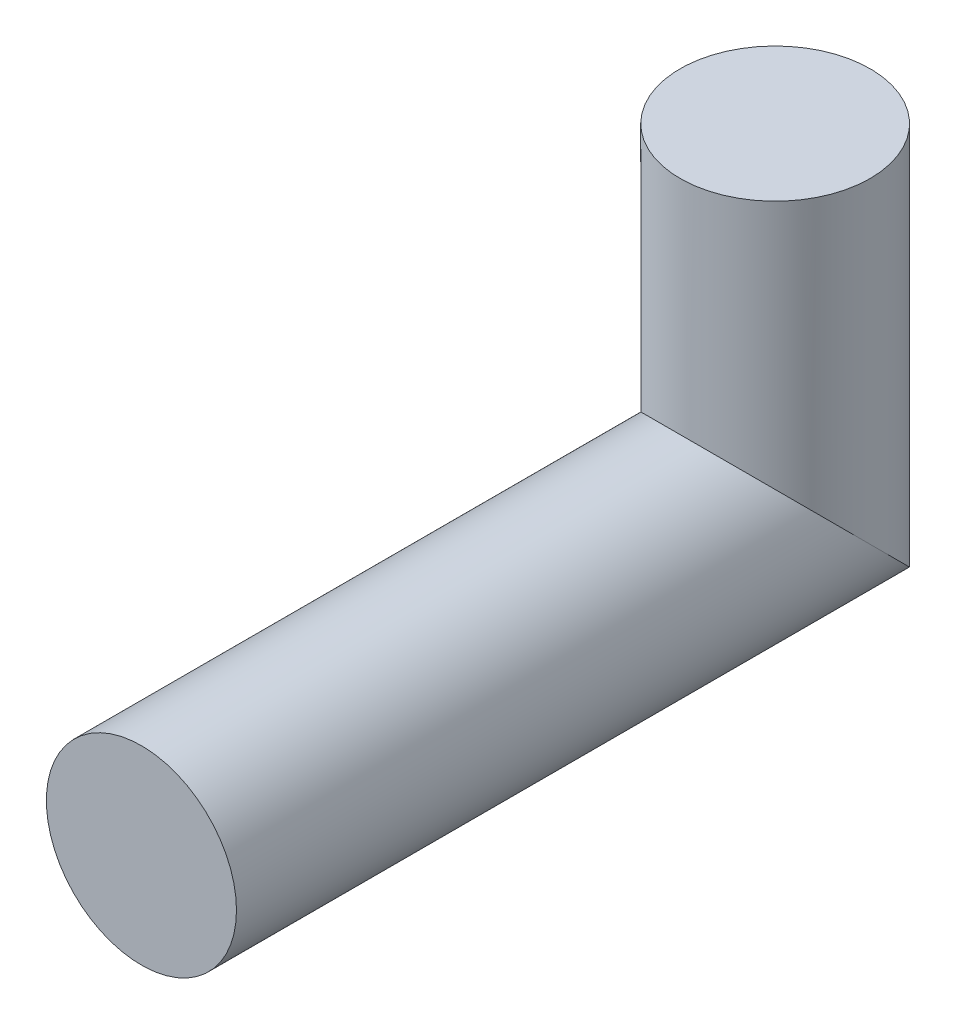
ISO-10303-21;
HEADER;
FILE_DESCRIPTION(('STEP AP214'),'2;1');
FILE_NAME('part.step','',(''),(''),'','','');
FILE_SCHEMA(('AUTOMOTIVE_DESIGN { 1 0 10303 214 1 1 1 1 }'));
ENDSEC;
DATA;
#1=APPLICATION_CONTEXT('core data for automotive mechanical design processes');
#2=APPLICATION_PROTOCOL_DEFINITION('international standard','automotive_design',2000,#1);
#3=PRODUCT_CONTEXT('',#1,'mechanical');
#4=PRODUCT('Part','Part','',(#3));
#5=PRODUCT_RELATED_PRODUCT_CATEGORY('part','',(#4));
#6=PRODUCT_DEFINITION_FORMATION('','',#4);
#7=PRODUCT_DEFINITION_CONTEXT('part definition',#1,'design');
#8=PRODUCT_DEFINITION('design','',#6,#7);
#9=PRODUCT_DEFINITION_SHAPE('','',#8);
#10=(LENGTH_UNIT() NAMED_UNIT(*) SI_UNIT(.MILLI.,.METRE.));
#11=(NAMED_UNIT(*) PLANE_ANGLE_UNIT() SI_UNIT($,.RADIAN.));
#12=(NAMED_UNIT(*) SI_UNIT($,.STERADIAN.) SOLID_ANGLE_UNIT());
#13=UNCERTAINTY_MEASURE_WITH_UNIT(LENGTH_MEASURE(1.E-05),#10,'distance_accuracy_value','');
#14=(GEOMETRIC_REPRESENTATION_CONTEXT(3) GLOBAL_UNCERTAINTY_ASSIGNED_CONTEXT((#13)) GLOBAL_UNIT_ASSIGNED_CONTEXT((#10,
#11,#12)) REPRESENTATION_CONTEXT('',''));
#15=CARTESIAN_POINT('',(0.,0.,0.));
#16=DIRECTION('',(0.,0.,1.));
#17=DIRECTION('',(1.,0.,0.));
#18=AXIS2_PLACEMENT_3D('',#15,#16,#17);
#19=CARTESIAN_POINT('',(0.,63.5,-127.));
#20=DIRECTION('',(0.,-1.,0.));
#21=DIRECTION('',(1.,0.,0.));
#22=AXIS2_PLACEMENT_3D('',#19,#20,#21);
#23=PLANE('',#22);
#24=CARTESIAN_POINT('',(0.,63.5,-127.));
#25=DIRECTION('',(0.,-1.,0.));
#26=DIRECTION('',(1.,0.,0.));
#27=AXIS2_PLACEMENT_3D('',#24,#25,#26);
#28=CIRCLE('',#27,19.05);
#29=CARTESIAN_POINT('',(19.05,63.5,-127.));
#30=VERTEX_POINT('',#29);
#31=EDGE_CURVE('E37',#30,#30,#28,.T.);
#32=ORIENTED_EDGE('',*,*,#31,.F.);
#33=EDGE_LOOP('',(#32));
#34=FACE_BOUND('',#33,.T.);
#35=ADVANCED_FACE('F34',(#34),#23,.F.);
#36=CARTESIAN_POINT('',(0.,0.,0.));
#37=DIRECTION('',(0.,0.,1.));
#38=DIRECTION('',(1.,0.,0.));
#39=AXIS2_PLACEMENT_3D('',#36,#37,#38);
#40=PLANE('',#39);
#41=CARTESIAN_POINT('',(0.,0.,0.));
#42=DIRECTION('',(0.,0.,1.));
#43=DIRECTION('',(1.,0.,0.));
#44=AXIS2_PLACEMENT_3D('',#41,#42,#43);
#45=CIRCLE('',#44,19.05);
#46=CARTESIAN_POINT('',(19.05,0.,0.));
#47=VERTEX_POINT('',#46);
#48=EDGE_CURVE('E41',#47,#47,#45,.T.);
#49=ORIENTED_EDGE('',*,*,#48,.T.);
#50=EDGE_LOOP('',(#49));
#51=FACE_BOUND('',#50,.T.);
#52=ADVANCED_FACE('F54',(#51),#40,.T.);
#53=CARTESIAN_POINT('',(0.,-42.01,-127.));
#54=DIRECTION('',(0.,1.,0.));
#55=DIRECTION('',(0.,0.,1.));
#56=AXIS2_PLACEMENT_3D('',#53,#54,#55);
#57=CYLINDRICAL_SURFACE('',#56,19.05);
#58=CARTESIAN_POINT('',(0.,0.,-127.));
#59=DIRECTION('',(0.,0.707106781186547,-0.707106781186547));
#60=DIRECTION('',(0.,-0.707106781186548,-0.707106781186548));
#61=AXIS2_PLACEMENT_3D('',#58,#59,#60);
#62=ELLIPSE('',#61,26.9407683632075,19.05);
#63=CARTESIAN_POINT('',(0.,-19.05,-146.05));
#64=VERTEX_POINT('',#63);
#65=EDGE_CURVE('E10',#64,#64,#62,.T.);
#66=ORIENTED_EDGE('',*,*,#65,.T.);
#67=EDGE_LOOP('',(#66));
#68=FACE_BOUND('',#67,.T.);
#69=ORIENTED_EDGE('',*,*,#31,.T.);
#70=EDGE_LOOP('',(#69));
#71=FACE_BOUND('',#70,.T.);
#72=ADVANCED_FACE('F51',(#68,#71),#57,.T.);
#73=CARTESIAN_POINT('',(0.,0.,0.));
#74=DIRECTION('',(0.,0.,-1.));
#75=DIRECTION('',(-1.,0.,0.));
#76=AXIS2_PLACEMENT_3D('',#73,#74,#75);
#77=CYLINDRICAL_SURFACE('',#76,19.05);
#78=ORIENTED_EDGE('',*,*,#48,.F.);
#79=EDGE_LOOP('',(#78));
#80=FACE_BOUND('',#79,.T.);
#81=ORIENTED_EDGE('',*,*,#65,.F.);
#82=EDGE_LOOP('',(#81));
#83=FACE_BOUND('',#82,.T.);
#84=ADVANCED_FACE('F58',(#80,#83),#77,.T.);
#85=CLOSED_SHELL('',(#35,#52,#72,#84));
#86=MANIFOLD_SOLID_BREP('B2',#85);
#87=ADVANCED_BREP_SHAPE_REPRESENTATION('',(#18,#86),#14);
#88=SHAPE_DEFINITION_REPRESENTATION(#9,#87);
ENDSEC;
END-ISO-10303-21;
